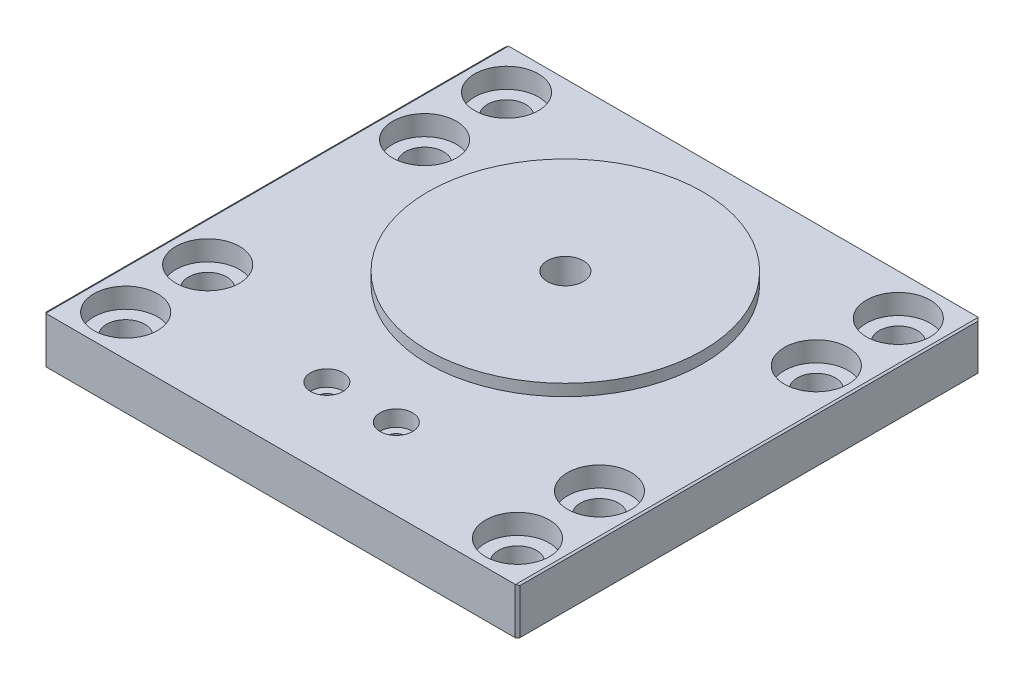
ISO-10303-21;
HEADER;
FILE_DESCRIPTION(('STEP AP214'),'2;1');
FILE_NAME('part.step','',(''),(''),'','','');
FILE_SCHEMA(('AUTOMOTIVE_DESIGN { 1 0 10303 214 1 1 1 1 }'));
ENDSEC;
DATA;
#1=APPLICATION_CONTEXT('core data for automotive mechanical design processes');
#2=APPLICATION_PROTOCOL_DEFINITION('international standard','automotive_design',2000,#1);
#3=PRODUCT_CONTEXT('',#1,'mechanical');
#4=PRODUCT('Part','Part','',(#3));
#5=PRODUCT_RELATED_PRODUCT_CATEGORY('part','',(#4));
#6=PRODUCT_DEFINITION_FORMATION('','',#4);
#7=PRODUCT_DEFINITION_CONTEXT('part definition',#1,'design');
#8=PRODUCT_DEFINITION('design','',#6,#7);
#9=PRODUCT_DEFINITION_SHAPE('','',#8);
#10=(LENGTH_UNIT() NAMED_UNIT(*) SI_UNIT(.MILLI.,.METRE.));
#11=(NAMED_UNIT(*) PLANE_ANGLE_UNIT() SI_UNIT($,.RADIAN.));
#12=(NAMED_UNIT(*) SI_UNIT($,.STERADIAN.) SOLID_ANGLE_UNIT());
#13=UNCERTAINTY_MEASURE_WITH_UNIT(LENGTH_MEASURE(1.E-05),#10,'distance_accuracy_value','');
#14=(GEOMETRIC_REPRESENTATION_CONTEXT(3) GLOBAL_UNCERTAINTY_ASSIGNED_CONTEXT((#13)) GLOBAL_UNIT_ASSIGNED_CONTEXT((#10,
#11,#12)) REPRESENTATION_CONTEXT('',''));
#15=CARTESIAN_POINT('',(0.,0.,0.));
#16=DIRECTION('',(0.,0.,1.));
#17=DIRECTION('',(1.,0.,0.));
#18=AXIS2_PLACEMENT_3D('',#15,#16,#17);
#19=CARTESIAN_POINT('',(-104.000000026,10.16,-101.6));
#20=DIRECTION('',(1.,0.,0.));
#21=DIRECTION('',(0.,0.,-1.));
#22=AXIS2_PLACEMENT_3D('',#19,#20,#21);
#23=PLANE('',#22);
#24=DIRECTION('',(0.,0.,1.));
#25=VECTOR('',#24,1.);
#26=CARTESIAN_POINT('',(-104.000000026,0.,-101.6));
#27=LINE('',#26,#25);
#28=CARTESIAN_POINT('',(-104.000000026,0.,-101.092));
#29=VERTEX_POINT('',#28);
#30=CARTESIAN_POINT('',(-104.000000026,0.,-0.507999999999953));
#31=VERTEX_POINT('',#30);
#32=EDGE_CURVE('E207',#29,#31,#27,.T.);
#33=ORIENTED_EDGE('',*,*,#32,.T.);
#34=DIRECTION('',(0.,1.,0.));
#35=VECTOR('',#34,1.);
#36=CARTESIAN_POINT('',(-104.000000026,10.16,-0.507999999999953));
#37=LINE('',#36,#35);
#38=CARTESIAN_POINT('',(-104.000000026,9.90599999999998,-0.507999999999953));
#39=VERTEX_POINT('',#38);
#40=EDGE_CURVE('E56',#31,#39,#37,.T.);
#41=ORIENTED_EDGE('',*,*,#40,.T.);
#42=DIRECTION('',(0.,0.,-1.));
#43=VECTOR('',#42,1.);
#44=CARTESIAN_POINT('',(-104.000000026,9.90599999999998,-101.6));
#45=LINE('',#44,#43);
#46=CARTESIAN_POINT('',(-104.000000026,9.90599999999998,-101.092));
#47=VERTEX_POINT('',#46);
#48=EDGE_CURVE('E124',#39,#47,#45,.T.);
#49=ORIENTED_EDGE('',*,*,#48,.T.);
#50=DIRECTION('',(0.,-1.,0.));
#51=VECTOR('',#50,1.);
#52=CARTESIAN_POINT('',(-104.000000026,10.16,-101.092));
#53=LINE('',#52,#51);
#54=EDGE_CURVE('E140',#47,#29,#53,.T.);
#55=ORIENTED_EDGE('',*,*,#54,.T.);
#56=EDGE_LOOP('',(#33,#41,#49,#55));
#57=FACE_BOUND('',#56,.T.);
#58=ADVANCED_FACE('F34',(#57),#23,.F.);
#59=CARTESIAN_POINT('',(-104.000000026,10.16,0.));
#60=DIRECTION('',(0.,0.,-1.));
#61=DIRECTION('',(-1.,0.,0.));
#62=AXIS2_PLACEMENT_3D('',#59,#60,#61);
#63=PLANE('',#62);
#64=DIRECTION('',(1.,0.,0.));
#65=VECTOR('',#64,1.);
#66=CARTESIAN_POINT('',(-104.000000026,0.,0.));
#67=LINE('',#66,#65);
#68=CARTESIAN_POINT('',(-103.492000026,0.,0.));
#69=VERTEX_POINT('',#68);
#70=CARTESIAN_POINT('',(-0.508000000000008,0.,0.));
#71=VERTEX_POINT('',#70);
#72=EDGE_CURVE('E170',#69,#71,#67,.T.);
#73=ORIENTED_EDGE('',*,*,#72,.T.);
#74=DIRECTION('',(0.,1.,0.));
#75=VECTOR('',#74,1.);
#76=CARTESIAN_POINT('',(-0.508000000000008,10.16,0.));
#77=LINE('',#76,#75);
#78=CARTESIAN_POINT('',(-0.508000000000008,10.16,0.));
#79=VERTEX_POINT('',#78);
#80=EDGE_CURVE('E189',#71,#79,#77,.T.);
#81=ORIENTED_EDGE('',*,*,#80,.T.);
#82=DIRECTION('',(1.,0.,0.));
#83=VECTOR('',#82,1.);
#84=CARTESIAN_POINT('',(-104.000000026,10.16,0.));
#85=LINE('',#84,#83);
#86=CARTESIAN_POINT('',(-103.492000026,10.16,0.));
#87=VERTEX_POINT('',#86);
#88=EDGE_CURVE('E166',#87,#79,#85,.T.);
#89=ORIENTED_EDGE('',*,*,#88,.F.);
#90=DIRECTION('',(0.,-1.,0.));
#91=VECTOR('',#90,1.);
#92=CARTESIAN_POINT('',(-103.492000026,10.16,0.));
#93=LINE('',#92,#91);
#94=EDGE_CURVE('E186',#87,#69,#93,.T.);
#95=ORIENTED_EDGE('',*,*,#94,.T.);
#96=EDGE_LOOP('',(#73,#81,#89,#95));
#97=FACE_BOUND('',#96,.T.);
#98=ADVANCED_FACE('F203',(#97),#63,.F.);
#99=CARTESIAN_POINT('',(0.,10.16,-101.6));
#100=DIRECTION('',(-1.,0.,0.));
#101=DIRECTION('',(0.,0.,1.));
#102=AXIS2_PLACEMENT_3D('',#99,#100,#101);
#103=PLANE('',#102);
#104=DIRECTION('',(0.,0.,1.));
#105=VECTOR('',#104,1.);
#106=CARTESIAN_POINT('',(0.,9.90600000000001,0.));
#107=LINE('',#106,#105);
#108=CARTESIAN_POINT('',(0.,9.90600000000001,-101.092));
#109=VERTEX_POINT('',#108);
#110=CARTESIAN_POINT('',(0.,9.90600000000001,-0.508000000000008));
#111=VERTEX_POINT('',#110);
#112=EDGE_CURVE('E117',#109,#111,#107,.T.);
#113=ORIENTED_EDGE('',*,*,#112,.T.);
#114=DIRECTION('',(0.,-1.,0.));
#115=VECTOR('',#114,1.);
#116=CARTESIAN_POINT('',(0.,10.16,-0.508000000000008));
#117=LINE('',#116,#115);
#118=CARTESIAN_POINT('',(0.,0.,-0.508000000000008));
#119=VERTEX_POINT('',#118);
#120=EDGE_CURVE('E123',#111,#119,#117,.T.);
#121=ORIENTED_EDGE('',*,*,#120,.T.);
#122=DIRECTION('',(0.,0.,-1.));
#123=VECTOR('',#122,1.);
#124=CARTESIAN_POINT('',(0.,0.,-101.6));
#125=LINE('',#124,#123);
#126=CARTESIAN_POINT('',(0.,0.,-101.092));
#127=VERTEX_POINT('',#126);
#128=EDGE_CURVE('E120',#119,#127,#125,.T.);
#129=ORIENTED_EDGE('',*,*,#128,.T.);
#130=DIRECTION('',(0.,1.,0.));
#131=VECTOR('',#130,1.);
#132=CARTESIAN_POINT('',(0.,10.16,-101.092));
#133=LINE('',#132,#131);
#134=EDGE_CURVE('E113',#127,#109,#133,.T.);
#135=ORIENTED_EDGE('',*,*,#134,.T.);
#136=EDGE_LOOP('',(#113,#121,#129,#135));
#137=FACE_BOUND('',#136,.T.);
#138=ADVANCED_FACE('F115',(#137),#103,.F.);
#139=CARTESIAN_POINT('',(-104.000000026,10.16,-101.6));
#140=DIRECTION('',(0.,0.,1.));
#141=DIRECTION('',(1.,0.,0.));
#142=AXIS2_PLACEMENT_3D('',#139,#140,#141);
#143=PLANE('',#142);
#144=DIRECTION('',(-1.,0.,0.));
#145=VECTOR('',#144,1.);
#146=CARTESIAN_POINT('',(-104.000000026,0.,-101.6));
#147=LINE('',#146,#145);
#148=CARTESIAN_POINT('',(-0.508000000000008,0.,-101.6));
#149=VERTEX_POINT('',#148);
#150=CARTESIAN_POINT('',(-103.492000026,0.,-101.6));
#151=VERTEX_POINT('',#150);
#152=EDGE_CURVE('E157',#149,#151,#147,.T.);
#153=ORIENTED_EDGE('',*,*,#152,.T.);
#154=DIRECTION('',(0.,1.,0.));
#155=VECTOR('',#154,1.);
#156=CARTESIAN_POINT('',(-103.492000026,10.16,-101.6));
#157=LINE('',#156,#155);
#158=CARTESIAN_POINT('',(-103.492000026,10.16,-101.6));
#159=VERTEX_POINT('',#158);
#160=EDGE_CURVE('E11',#151,#159,#157,.T.);
#161=ORIENTED_EDGE('',*,*,#160,.T.);
#162=DIRECTION('',(-1.,0.,0.));
#163=VECTOR('',#162,1.);
#164=CARTESIAN_POINT('',(-104.000000026,10.16,-101.6));
#165=LINE('',#164,#163);
#166=CARTESIAN_POINT('',(-0.508000000000008,10.16,-101.6));
#167=VERTEX_POINT('',#166);
#168=EDGE_CURVE('E160',#167,#159,#165,.T.);
#169=ORIENTED_EDGE('',*,*,#168,.F.);
#170=DIRECTION('',(0.,-1.,0.));
#171=VECTOR('',#170,1.);
#172=CARTESIAN_POINT('',(-0.508000000000008,10.16,-101.6));
#173=LINE('',#172,#171);
#174=EDGE_CURVE('E42',#167,#149,#173,.T.);
#175=ORIENTED_EDGE('',*,*,#174,.T.);
#176=EDGE_LOOP('',(#153,#161,#169,#175));
#177=FACE_BOUND('',#176,.T.);
#178=ADVANCED_FACE('F156',(#177),#143,.F.);
#179=CARTESIAN_POINT('',(0.,10.16,0.));
#180=DIRECTION('',(0.,1.,0.));
#181=DIRECTION('',(0.,0.,1.));
#182=AXIS2_PLACEMENT_3D('',#179,#180,#181);
#183=PLANE('',#182);
#184=CARTESIAN_POINT('',(-8.99999996132552,10.16,-92.6));
#185=DIRECTION('',(0.,1.,0.));
#186=DIRECTION('',(0.,0.,1.));
#187=AXIS2_PLACEMENT_3D('',#184,#185,#186);
#188=CIRCLE('',#187,7.);
#189=CARTESIAN_POINT('',(-8.99999996132552,10.16,-85.6));
#190=VERTEX_POINT('',#189);
#191=EDGE_CURVE('E341',#190,#190,#188,.T.);
#192=ORIENTED_EDGE('',*,*,#191,.F.);
#193=EDGE_LOOP('',(#192));
#194=FACE_BOUND('',#193,.T.);
#195=CARTESIAN_POINT('',(-8.99999996132552,10.16,-74.6));
#196=DIRECTION('',(0.,1.,0.));
#197=DIRECTION('',(0.,0.,1.));
#198=AXIS2_PLACEMENT_3D('',#195,#196,#197);
#199=CIRCLE('',#198,7.);
#200=CARTESIAN_POINT('',(-8.99999996132552,10.16,-67.6));
#201=VERTEX_POINT('',#200);
#202=EDGE_CURVE('E329',#201,#201,#199,.T.);
#203=ORIENTED_EDGE('',*,*,#202,.F.);
#204=EDGE_LOOP('',(#203));
#205=FACE_BOUND('',#204,.T.);
#206=CARTESIAN_POINT('',(-8.99999996132554,10.16,-27.));
#207=DIRECTION('',(0.,1.,0.));
#208=DIRECTION('',(0.,0.,1.));
#209=AXIS2_PLACEMENT_3D('',#206,#207,#208);
#210=CIRCLE('',#209,7.);
#211=CARTESIAN_POINT('',(-8.99999996132554,10.16,-20.));
#212=VERTEX_POINT('',#211);
#213=EDGE_CURVE('E317',#212,#212,#210,.T.);
#214=ORIENTED_EDGE('',*,*,#213,.F.);
#215=EDGE_LOOP('',(#214));
#216=FACE_BOUND('',#215,.T.);
#217=CARTESIAN_POINT('',(-8.99999996132554,10.16,-8.99999999999997));
#218=DIRECTION('',(0.,1.,0.));
#219=DIRECTION('',(0.,0.,1.));
#220=AXIS2_PLACEMENT_3D('',#217,#218,#219);
#221=CIRCLE('',#220,7.);
#222=CARTESIAN_POINT('',(-8.99999996132554,10.16,-1.99999999999997));
#223=VERTEX_POINT('',#222);
#224=EDGE_CURVE('E305',#223,#223,#221,.T.);
#225=ORIENTED_EDGE('',*,*,#224,.F.);
#226=EDGE_LOOP('',(#225));
#227=FACE_BOUND('',#226,.T.);
#228=CARTESIAN_POINT('',(-95.000000013,10.16,-8.99999999999995));
#229=DIRECTION('',(0.,1.,0.));
#230=DIRECTION('',(0.,0.,1.));
#231=AXIS2_PLACEMENT_3D('',#228,#229,#230);
#232=CIRCLE('',#231,7.00000000000001);
#233=CARTESIAN_POINT('',(-95.000000013,10.16,-1.99999999999995));
#234=VERTEX_POINT('',#233);
#235=EDGE_CURVE('E293',#234,#234,#232,.T.);
#236=ORIENTED_EDGE('',*,*,#235,.F.);
#237=EDGE_LOOP('',(#236));
#238=FACE_BOUND('',#237,.T.);
#239=CARTESIAN_POINT('',(-95.000000013,10.16,-27.));
#240=DIRECTION('',(0.,1.,0.));
#241=DIRECTION('',(0.,0.,1.));
#242=AXIS2_PLACEMENT_3D('',#239,#240,#241);
#243=CIRCLE('',#242,7.00000000000001);
#244=CARTESIAN_POINT('',(-95.000000013,10.16,-19.9999999999999));
#245=VERTEX_POINT('',#244);
#246=EDGE_CURVE('E281',#245,#245,#243,.T.);
#247=ORIENTED_EDGE('',*,*,#246,.F.);
#248=EDGE_LOOP('',(#247));
#249=FACE_BOUND('',#248,.T.);
#250=CARTESIAN_POINT('',(-95.000000013,10.16,-74.6));
#251=DIRECTION('',(0.,1.,0.));
#252=DIRECTION('',(0.,0.,1.));
#253=AXIS2_PLACEMENT_3D('',#250,#251,#252);
#254=CIRCLE('',#253,7.00000000000001);
#255=CARTESIAN_POINT('',(-95.000000013,10.16,-67.6));
#256=VERTEX_POINT('',#255);
#257=EDGE_CURVE('E269',#256,#256,#254,.T.);
#258=ORIENTED_EDGE('',*,*,#257,.F.);
#259=EDGE_LOOP('',(#258));
#260=FACE_BOUND('',#259,.T.);
#261=CARTESIAN_POINT('',(-95.000000013,10.16,-92.6));
#262=DIRECTION('',(0.,1.,0.));
#263=DIRECTION('',(0.,0.,1.));
#264=AXIS2_PLACEMENT_3D('',#261,#262,#263);
#265=CIRCLE('',#264,7.00000000000001);
#266=CARTESIAN_POINT('',(-95.000000013,10.16,-85.6));
#267=VERTEX_POINT('',#266);
#268=EDGE_CURVE('E257',#267,#267,#265,.T.);
#269=ORIENTED_EDGE('',*,*,#268,.F.);
#270=EDGE_LOOP('',(#269));
#271=FACE_BOUND('',#270,.T.);
#272=CARTESIAN_POINT('',(-59.620000013,10.16,-17.78));
#273=DIRECTION('',(0.,1.,0.));
#274=DIRECTION('',(0.,0.,1.));
#275=AXIS2_PLACEMENT_3D('',#272,#273,#274);
#276=CIRCLE('',#275,3.57251);
#277=CARTESIAN_POINT('',(-59.620000013,10.16,-14.20749));
#278=VERTEX_POINT('',#277);
#279=EDGE_CURVE('E239',#278,#278,#276,.T.);
#280=ORIENTED_EDGE('',*,*,#279,.F.);
#281=EDGE_LOOP('',(#280));
#282=FACE_BOUND('',#281,.T.);
#283=CARTESIAN_POINT('',(-44.380000013,10.16,-17.78));
#284=DIRECTION('',(0.,1.,0.));
#285=DIRECTION('',(0.,0.,1.));
#286=AXIS2_PLACEMENT_3D('',#283,#284,#285);
#287=CIRCLE('',#286,3.57251);
#288=CARTESIAN_POINT('',(-44.380000013,10.16,-14.20749));
#289=VERTEX_POINT('',#288);
#290=EDGE_CURVE('E227',#289,#289,#287,.T.);
#291=ORIENTED_EDGE('',*,*,#290,.F.);
#292=EDGE_LOOP('',(#291));
#293=FACE_BOUND('',#292,.T.);
#294=CARTESIAN_POINT('',(-52.000000013,10.16,-62.5094));
#295=DIRECTION('',(0.,1.,0.));
#296=DIRECTION('',(0.,0.,1.));
#297=AXIS2_PLACEMENT_3D('',#294,#295,#296);
#298=CIRCLE('',#297,30.1625);
#299=CARTESIAN_POINT('',(-52.000000013,10.16,-32.3469));
#300=VERTEX_POINT('',#299);
#301=EDGE_CURVE('E212',#300,#300,#298,.T.);
#302=ORIENTED_EDGE('',*,*,#301,.F.);
#303=EDGE_LOOP('',(#302));
#304=FACE_BOUND('',#303,.T.);
#305=ORIENTED_EDGE('',*,*,#88,.T.);
#306=DIRECTION('',(-0.707106781186548,0.,0.707106781186548));
#307=VECTOR('',#306,1.);
#308=CARTESIAN_POINT('',(-0.254000000000004,10.16,-0.254000000000004));
#309=LINE('',#308,#307);
#310=CARTESIAN_POINT('',(-0.439940905122477,10.16,-0.0680590948775178));
#311=VERTEX_POINT('',#310);
#312=EDGE_CURVE('E138',#79,#311,#309,.F.);
#313=ORIENTED_EDGE('',*,*,#312,.T.);
#314=DIRECTION('',(0.,0.,-1.));
#315=VECTOR('',#314,1.);
#316=CARTESIAN_POINT('',(-0.439940905122477,10.16,-101.6));
#317=LINE('',#316,#315);
#318=CARTESIAN_POINT('',(-0.439940905122477,10.16,-101.531940905122));
#319=VERTEX_POINT('',#318);
#320=EDGE_CURVE('E133',#311,#319,#317,.T.);
#321=ORIENTED_EDGE('',*,*,#320,.T.);
#322=DIRECTION('',(0.707106781186547,0.,0.707106781186548));
#323=VECTOR('',#322,1.);
#324=CARTESIAN_POINT('',(50.546,10.16,-50.546));
#325=LINE('',#324,#323);
#326=EDGE_CURVE('E137',#319,#167,#325,.F.);
#327=ORIENTED_EDGE('',*,*,#326,.T.);
#328=ORIENTED_EDGE('',*,*,#168,.T.);
#329=DIRECTION('',(0.707106781186538,0.,-0.707106781186557));
#330=VECTOR('',#329,1.);
#331=CARTESIAN_POINT('',(-102.546000013001,10.16,-102.546000012999));
#332=LINE('',#331,#330);
#333=CARTESIAN_POINT('',(-103.560059120877,10.16,-101.531940905123));
#334=VERTEX_POINT('',#333);
#335=EDGE_CURVE('E192',#159,#334,#332,.F.);
#336=ORIENTED_EDGE('',*,*,#335,.T.);
#337=DIRECTION('',(0.,0.,1.));
#338=VECTOR('',#337,1.);
#339=CARTESIAN_POINT('',(-103.560059120877,10.16,0.));
#340=LINE('',#339,#338);
#341=CARTESIAN_POINT('',(-103.560059120877,10.16,-0.0680590948774188));
#342=VERTEX_POINT('',#341);
#343=EDGE_CURVE('E174',#334,#342,#340,.T.);
#344=ORIENTED_EDGE('',*,*,#343,.T.);
#345=DIRECTION('',(-0.707106781186557,0.,-0.707106781186538));
#346=VECTOR('',#345,1.);
#347=CARTESIAN_POINT('',(-51.7460000129986,10.16,51.746000013));
#348=LINE('',#347,#346);
#349=EDGE_CURVE('E142',#342,#87,#348,.F.);
#350=ORIENTED_EDGE('',*,*,#349,.T.);
#351=EDGE_LOOP('',(#305,#313,#321,#327,#328,#336,#344,#350));
#352=FACE_BOUND('',#351,.T.);
#353=ADVANCED_FACE('F196',(#194,#205,#216,#227,#238,#249,#260,#271,#282,#293,#304,#352),#183,.T.);
#354=CARTESIAN_POINT('',(0.,0.,0.));
#355=DIRECTION('',(0.,1.,0.));
#356=DIRECTION('',(0.,0.,1.));
#357=AXIS2_PLACEMENT_3D('',#354,#355,#356);
#358=PLANE('',#357);
#359=CARTESIAN_POINT('',(-8.99999996132552,0.,-92.6));
#360=DIRECTION('',(0.,1.,0.));
#361=DIRECTION('',(0.,0.,1.));
#362=AXIS2_PLACEMENT_3D('',#359,#360,#361);
#363=CIRCLE('',#362,4.2);
#364=CARTESIAN_POINT('',(-8.99999996132552,0.,-88.4));
#365=VERTEX_POINT('',#364);
#366=EDGE_CURVE('E332',#365,#365,#363,.T.);
#367=ORIENTED_EDGE('',*,*,#366,.T.);
#368=EDGE_LOOP('',(#367));
#369=FACE_BOUND('',#368,.T.);
#370=CARTESIAN_POINT('',(-8.99999996132552,0.,-74.6));
#371=DIRECTION('',(0.,1.,0.));
#372=DIRECTION('',(0.,0.,1.));
#373=AXIS2_PLACEMENT_3D('',#370,#371,#372);
#374=CIRCLE('',#373,4.2);
#375=CARTESIAN_POINT('',(-8.99999996132552,0.,-70.4));
#376=VERTEX_POINT('',#375);
#377=EDGE_CURVE('E320',#376,#376,#374,.T.);
#378=ORIENTED_EDGE('',*,*,#377,.T.);
#379=EDGE_LOOP('',(#378));
#380=FACE_BOUND('',#379,.T.);
#381=CARTESIAN_POINT('',(-8.99999996132554,0.,-27.));
#382=DIRECTION('',(0.,1.,0.));
#383=DIRECTION('',(0.,0.,1.));
#384=AXIS2_PLACEMENT_3D('',#381,#382,#383);
#385=CIRCLE('',#384,4.2);
#386=CARTESIAN_POINT('',(-8.99999996132554,0.,-22.8));
#387=VERTEX_POINT('',#386);
#388=EDGE_CURVE('E308',#387,#387,#385,.T.);
#389=ORIENTED_EDGE('',*,*,#388,.T.);
#390=EDGE_LOOP('',(#389));
#391=FACE_BOUND('',#390,.T.);
#392=CARTESIAN_POINT('',(-8.99999996132554,0.,-8.99999999999997));
#393=DIRECTION('',(0.,1.,0.));
#394=DIRECTION('',(0.,0.,1.));
#395=AXIS2_PLACEMENT_3D('',#392,#393,#394);
#396=CIRCLE('',#395,4.2);
#397=CARTESIAN_POINT('',(-8.99999996132554,0.,-4.79999999999997));
#398=VERTEX_POINT('',#397);
#399=EDGE_CURVE('E296',#398,#398,#396,.T.);
#400=ORIENTED_EDGE('',*,*,#399,.T.);
#401=EDGE_LOOP('',(#400));
#402=FACE_BOUND('',#401,.T.);
#403=CARTESIAN_POINT('',(-95.000000013,0.,-8.99999999999995));
#404=DIRECTION('',(0.,1.,0.));
#405=DIRECTION('',(0.,0.,1.));
#406=AXIS2_PLACEMENT_3D('',#403,#404,#405);
#407=CIRCLE('',#406,4.2);
#408=CARTESIAN_POINT('',(-95.000000013,0.,-4.79999999999996));
#409=VERTEX_POINT('',#408);
#410=EDGE_CURVE('E284',#409,#409,#407,.T.);
#411=ORIENTED_EDGE('',*,*,#410,.T.);
#412=EDGE_LOOP('',(#411));
#413=FACE_BOUND('',#412,.T.);
#414=CARTESIAN_POINT('',(-95.000000013,0.,-27.));
#415=DIRECTION('',(0.,1.,0.));
#416=DIRECTION('',(0.,0.,1.));
#417=AXIS2_PLACEMENT_3D('',#414,#415,#416);
#418=CIRCLE('',#417,4.2);
#419=CARTESIAN_POINT('',(-95.000000013,0.,-22.8));
#420=VERTEX_POINT('',#419);
#421=EDGE_CURVE('E272',#420,#420,#418,.T.);
#422=ORIENTED_EDGE('',*,*,#421,.T.);
#423=EDGE_LOOP('',(#422));
#424=FACE_BOUND('',#423,.T.);
#425=CARTESIAN_POINT('',(-95.000000013,0.,-74.6));
#426=DIRECTION('',(0.,1.,0.));
#427=DIRECTION('',(0.,0.,1.));
#428=AXIS2_PLACEMENT_3D('',#425,#426,#427);
#429=CIRCLE('',#428,4.2);
#430=CARTESIAN_POINT('',(-95.000000013,0.,-70.4));
#431=VERTEX_POINT('',#430);
#432=EDGE_CURVE('E260',#431,#431,#429,.T.);
#433=ORIENTED_EDGE('',*,*,#432,.T.);
#434=EDGE_LOOP('',(#433));
#435=FACE_BOUND('',#434,.T.);
#436=CARTESIAN_POINT('',(-95.000000013,0.,-92.6));
#437=DIRECTION('',(0.,1.,0.));
#438=DIRECTION('',(0.,0.,1.));
#439=AXIS2_PLACEMENT_3D('',#436,#437,#438);
#440=CIRCLE('',#439,4.2);
#441=CARTESIAN_POINT('',(-95.000000013,0.,-88.4));
#442=VERTEX_POINT('',#441);
#443=EDGE_CURVE('E248',#442,#442,#440,.T.);
#444=ORIENTED_EDGE('',*,*,#443,.T.);
#445=EDGE_LOOP('',(#444));
#446=FACE_BOUND('',#445,.T.);
#447=CARTESIAN_POINT('',(-52.000000013,0.,-62.5094));
#448=DIRECTION('',(0.,1.,0.));
#449=DIRECTION('',(0.,0.,1.));
#450=AXIS2_PLACEMENT_3D('',#447,#448,#449);
#451=CIRCLE('',#450,3.96874999999994);
#452=CARTESIAN_POINT('',(-52.000000013,0.,-58.5406500000001));
#453=VERTEX_POINT('',#452);
#454=EDGE_CURVE('E242',#453,#453,#451,.T.);
#455=ORIENTED_EDGE('',*,*,#454,.T.);
#456=EDGE_LOOP('',(#455));
#457=FACE_BOUND('',#456,.T.);
#458=CARTESIAN_POINT('',(-59.620000013,0.,-17.78));
#459=DIRECTION('',(0.,1.,0.));
#460=DIRECTION('',(0.,0.,1.));
#461=AXIS2_PLACEMENT_3D('',#458,#459,#460);
#462=CIRCLE('',#461,1.89864999999999);
#463=CARTESIAN_POINT('',(-59.620000013,0.,-15.88135));
#464=VERTEX_POINT('',#463);
#465=EDGE_CURVE('E230',#464,#464,#462,.T.);
#466=ORIENTED_EDGE('',*,*,#465,.T.);
#467=EDGE_LOOP('',(#466));
#468=FACE_BOUND('',#467,.T.);
#469=CARTESIAN_POINT('',(-44.380000013,0.,-17.78));
#470=DIRECTION('',(0.,1.,0.));
#471=DIRECTION('',(0.,0.,1.));
#472=AXIS2_PLACEMENT_3D('',#469,#470,#471);
#473=CIRCLE('',#472,1.89864999999999);
#474=CARTESIAN_POINT('',(-44.380000013,0.,-15.88135));
#475=VERTEX_POINT('',#474);
#476=EDGE_CURVE('E217',#475,#475,#473,.T.);
#477=ORIENTED_EDGE('',*,*,#476,.T.);
#478=EDGE_LOOP('',(#477));
#479=FACE_BOUND('',#478,.T.);
#480=ORIENTED_EDGE('',*,*,#128,.F.);
#481=DIRECTION('',(0.707106781186548,0.,-0.707106781186548));
#482=VECTOR('',#481,1.);
#483=CARTESIAN_POINT('',(0.,0.,-0.508000000000008));
#484=LINE('',#483,#482);
#485=EDGE_CURVE('E184',#119,#71,#484,.F.);
#486=ORIENTED_EDGE('',*,*,#485,.T.);
#487=ORIENTED_EDGE('',*,*,#72,.F.);
#488=DIRECTION('',(0.707106781186557,0.,0.707106781186538));
#489=VECTOR('',#488,1.);
#490=CARTESIAN_POINT('',(-103.492000026,0.,0.));
#491=LINE('',#490,#489);
#492=EDGE_CURVE('E182',#69,#31,#491,.F.);
#493=ORIENTED_EDGE('',*,*,#492,.T.);
#494=ORIENTED_EDGE('',*,*,#32,.F.);
#495=DIRECTION('',(-0.707106781186538,0.,0.707106781186557));
#496=VECTOR('',#495,1.);
#497=CARTESIAN_POINT('',(-104.000000026,0.,-101.092));
#498=LINE('',#497,#496);
#499=EDGE_CURVE('E165',#29,#151,#498,.F.);
#500=ORIENTED_EDGE('',*,*,#499,.T.);
#501=ORIENTED_EDGE('',*,*,#152,.F.);
#502=DIRECTION('',(-0.707106781186547,0.,-0.707106781186548));
#503=VECTOR('',#502,1.);
#504=CARTESIAN_POINT('',(-0.508000000000008,0.,-101.6));
#505=LINE('',#504,#503);
#506=EDGE_CURVE('E163',#149,#127,#505,.F.);
#507=ORIENTED_EDGE('',*,*,#506,.T.);
#508=EDGE_LOOP('',(#480,#486,#487,#493,#494,#500,#501,#507));
#509=FACE_BOUND('',#508,.T.);
#510=ADVANCED_FACE('F162',(#369,#380,#391,#402,#413,#424,#435,#446,#457,#468,#479,#509),#358,.F.);
#511=CARTESIAN_POINT('',(-52.000000013,12.7,-62.5094));
#512=DIRECTION('',(0.,-1.,0.));
#513=DIRECTION('',(0.,0.,-1.));
#514=AXIS2_PLACEMENT_3D('',#511,#512,#513);
#515=CYLINDRICAL_SURFACE('',#514,30.1625);
#516=CARTESIAN_POINT('',(-52.000000013,12.7,-62.5094));
#517=DIRECTION('',(0.,1.,0.));
#518=DIRECTION('',(0.,0.,1.));
#519=AXIS2_PLACEMENT_3D('',#516,#517,#518);
#520=CIRCLE('',#519,30.1625);
#521=CARTESIAN_POINT('',(-52.000000013,12.7,-32.3469));
#522=VERTEX_POINT('',#521);
#523=EDGE_CURVE('E209',#522,#522,#520,.T.);
#524=ORIENTED_EDGE('',*,*,#523,.F.);
#525=EDGE_LOOP('',(#524));
#526=FACE_BOUND('',#525,.T.);
#527=ORIENTED_EDGE('',*,*,#301,.T.);
#528=EDGE_LOOP('',(#527));
#529=FACE_BOUND('',#528,.T.);
#530=ADVANCED_FACE('F370',(#526,#529),#515,.T.);
#531=CARTESIAN_POINT('',(-52.000000013,12.7,-62.5094));
#532=DIRECTION('',(0.,1.,0.));
#533=DIRECTION('',(0.,0.,1.));
#534=AXIS2_PLACEMENT_3D('',#531,#532,#533);
#535=PLANE('',#534);
#536=CARTESIAN_POINT('',(-52.000000013,12.7,-62.5094));
#537=DIRECTION('',(0.,1.,0.));
#538=DIRECTION('',(0.,0.,1.));
#539=AXIS2_PLACEMENT_3D('',#536,#537,#538);
#540=CIRCLE('',#539,3.96874999999999);
#541=CARTESIAN_POINT('',(-52.000000013,12.7,-58.54065));
#542=VERTEX_POINT('',#541);
#543=EDGE_CURVE('E245',#542,#542,#540,.T.);
#544=ORIENTED_EDGE('',*,*,#543,.F.);
#545=EDGE_LOOP('',(#544));
#546=FACE_BOUND('',#545,.T.);
#547=ORIENTED_EDGE('',*,*,#523,.T.);
#548=EDGE_LOOP('',(#547));
#549=FACE_BOUND('',#548,.T.);
#550=ADVANCED_FACE('F372',(#546,#549),#535,.T.);
#551=CARTESIAN_POINT('',(-44.380000013,10.16,-17.78));
#552=DIRECTION('',(0.,1.,0.));
#553=DIRECTION('',(0.,0.,1.));
#554=AXIS2_PLACEMENT_3D('',#551,#552,#553);
#555=CYLINDRICAL_SURFACE('',#554,1.89865);
#556=ORIENTED_EDGE('',*,*,#476,.F.);
#557=EDGE_LOOP('',(#556));
#558=FACE_BOUND('',#557,.T.);
#559=CARTESIAN_POINT('',(-44.380000013,6.6548,-17.78));
#560=DIRECTION('',(0.,1.,0.));
#561=DIRECTION('',(0.,0.,1.));
#562=AXIS2_PLACEMENT_3D('',#559,#560,#561);
#563=CIRCLE('',#562,1.89865);
#564=CARTESIAN_POINT('',(-44.380000013,6.6548,-15.88135));
#565=VERTEX_POINT('',#564);
#566=EDGE_CURVE('E221',#565,#565,#563,.T.);
#567=ORIENTED_EDGE('',*,*,#566,.T.);
#568=EDGE_LOOP('',(#567));
#569=FACE_BOUND('',#568,.T.);
#570=ADVANCED_FACE('F379',(#558,#569),#555,.F.);
#571=CARTESIAN_POINT('',(-42.481350013,6.6548,-17.78));
#572=DIRECTION('',(0.,-1.,0.));
#573=DIRECTION('',(0.,0.,-1.));
#574=AXIS2_PLACEMENT_3D('',#571,#572,#573);
#575=PLANE('',#574);
#576=ORIENTED_EDGE('',*,*,#566,.F.);
#577=EDGE_LOOP('',(#576));
#578=FACE_BOUND('',#577,.T.);
#579=CARTESIAN_POINT('',(-44.380000013,6.6548,-17.78));
#580=DIRECTION('',(0.,1.,0.));
#581=DIRECTION('',(0.,0.,1.));
#582=AXIS2_PLACEMENT_3D('',#579,#580,#581);
#583=CIRCLE('',#582,3.57251);
#584=CARTESIAN_POINT('',(-44.380000013,6.6548,-14.20749));
#585=VERTEX_POINT('',#584);
#586=EDGE_CURVE('E224',#585,#585,#583,.T.);
#587=ORIENTED_EDGE('',*,*,#586,.T.);
#588=EDGE_LOOP('',(#587));
#589=FACE_BOUND('',#588,.T.);
#590=ADVANCED_FACE('F814',(#578,#589),#575,.F.);
#591=CARTESIAN_POINT('',(-44.380000013,10.16,-17.78));
#592=DIRECTION('',(0.,1.,0.));
#593=DIRECTION('',(0.,0.,1.));
#594=AXIS2_PLACEMENT_3D('',#591,#592,#593);
#595=CYLINDRICAL_SURFACE('',#594,3.57251);
#596=ORIENTED_EDGE('',*,*,#586,.F.);
#597=EDGE_LOOP('',(#596));
#598=FACE_BOUND('',#597,.T.);
#599=ORIENTED_EDGE('',*,*,#290,.T.);
#600=EDGE_LOOP('',(#599));
#601=FACE_BOUND('',#600,.T.);
#602=ADVANCED_FACE('F803',(#598,#601),#595,.F.);
#603=CARTESIAN_POINT('',(-59.620000013,10.16,-17.78));
#604=DIRECTION('',(0.,1.,0.));
#605=DIRECTION('',(0.,0.,1.));
#606=AXIS2_PLACEMENT_3D('',#603,#604,#605);
#607=CYLINDRICAL_SURFACE('',#606,1.89865);
#608=ORIENTED_EDGE('',*,*,#465,.F.);
#609=EDGE_LOOP('',(#608));
#610=FACE_BOUND('',#609,.T.);
#611=CARTESIAN_POINT('',(-59.620000013,6.6548,-17.78));
#612=DIRECTION('',(0.,1.,0.));
#613=DIRECTION('',(0.,0.,1.));
#614=AXIS2_PLACEMENT_3D('',#611,#612,#613);
#615=CIRCLE('',#614,1.89865);
#616=CARTESIAN_POINT('',(-59.620000013,6.6548,-15.88135));
#617=VERTEX_POINT('',#616);
#618=EDGE_CURVE('E233',#617,#617,#615,.T.);
#619=ORIENTED_EDGE('',*,*,#618,.T.);
#620=EDGE_LOOP('',(#619));
#621=FACE_BOUND('',#620,.T.);
#622=ADVANCED_FACE('F792',(#610,#621),#607,.F.);
#623=CARTESIAN_POINT('',(-57.721350013,6.6548,-17.78));
#624=DIRECTION('',(0.,-1.,0.));
#625=DIRECTION('',(0.,0.,-1.));
#626=AXIS2_PLACEMENT_3D('',#623,#624,#625);
#627=PLANE('',#626);
#628=ORIENTED_EDGE('',*,*,#618,.F.);
#629=EDGE_LOOP('',(#628));
#630=FACE_BOUND('',#629,.T.);
#631=CARTESIAN_POINT('',(-59.620000013,6.6548,-17.78));
#632=DIRECTION('',(0.,1.,0.));
#633=DIRECTION('',(0.,0.,1.));
#634=AXIS2_PLACEMENT_3D('',#631,#632,#633);
#635=CIRCLE('',#634,3.57251);
#636=CARTESIAN_POINT('',(-59.620000013,6.6548,-14.20749));
#637=VERTEX_POINT('',#636);
#638=EDGE_CURVE('E236',#637,#637,#635,.T.);
#639=ORIENTED_EDGE('',*,*,#638,.T.);
#640=EDGE_LOOP('',(#639));
#641=FACE_BOUND('',#640,.T.);
#642=ADVANCED_FACE('F781',(#630,#641),#627,.F.);
#643=CARTESIAN_POINT('',(-59.620000013,10.16,-17.78));
#644=DIRECTION('',(0.,1.,0.));
#645=DIRECTION('',(0.,0.,1.));
#646=AXIS2_PLACEMENT_3D('',#643,#644,#645);
#647=CYLINDRICAL_SURFACE('',#646,3.57251);
#648=ORIENTED_EDGE('',*,*,#638,.F.);
#649=EDGE_LOOP('',(#648));
#650=FACE_BOUND('',#649,.T.);
#651=ORIENTED_EDGE('',*,*,#279,.T.);
#652=EDGE_LOOP('',(#651));
#653=FACE_BOUND('',#652,.T.);
#654=ADVANCED_FACE('F762',(#650,#653),#647,.F.);
#655=CARTESIAN_POINT('',(-52.000000013,12.7,-62.5094));
#656=DIRECTION('',(0.,1.,0.));
#657=DIRECTION('',(0.,0.,1.));
#658=AXIS2_PLACEMENT_3D('',#655,#656,#657);
#659=CYLINDRICAL_SURFACE('',#658,3.96874999999997);
#660=ORIENTED_EDGE('',*,*,#454,.F.);
#661=EDGE_LOOP('',(#660));
#662=FACE_BOUND('',#661,.T.);
#663=ORIENTED_EDGE('',*,*,#543,.T.);
#664=EDGE_LOOP('',(#663));
#665=FACE_BOUND('',#664,.T.);
#666=ADVANCED_FACE('F750',(#662,#665),#659,.F.);
#667=CARTESIAN_POINT('',(-95.000000013,10.16,-92.6));
#668=DIRECTION('',(0.,1.,0.));
#669=DIRECTION('',(0.,0.,1.));
#670=AXIS2_PLACEMENT_3D('',#667,#668,#669);
#671=CYLINDRICAL_SURFACE('',#670,4.2);
#672=ORIENTED_EDGE('',*,*,#443,.F.);
#673=EDGE_LOOP('',(#672));
#674=FACE_BOUND('',#673,.T.);
#675=CARTESIAN_POINT('',(-95.000000013,5.76,-92.6));
#676=DIRECTION('',(0.,1.,0.));
#677=DIRECTION('',(0.,0.,1.));
#678=AXIS2_PLACEMENT_3D('',#675,#676,#677);
#679=CIRCLE('',#678,4.2);
#680=CARTESIAN_POINT('',(-95.000000013,5.76,-88.4));
#681=VERTEX_POINT('',#680);
#682=EDGE_CURVE('E251',#681,#681,#679,.T.);
#683=ORIENTED_EDGE('',*,*,#682,.T.);
#684=EDGE_LOOP('',(#683));
#685=FACE_BOUND('',#684,.T.);
#686=ADVANCED_FACE('F739',(#674,#685),#671,.F.);
#687=CARTESIAN_POINT('',(-90.800000013,5.76,-92.6));
#688=DIRECTION('',(0.,-1.,0.));
#689=DIRECTION('',(0.,0.,-1.));
#690=AXIS2_PLACEMENT_3D('',#687,#688,#689);
#691=PLANE('',#690);
#692=ORIENTED_EDGE('',*,*,#682,.F.);
#693=EDGE_LOOP('',(#692));
#694=FACE_BOUND('',#693,.T.);
#695=CARTESIAN_POINT('',(-95.000000013,5.76,-92.6));
#696=DIRECTION('',(0.,1.,0.));
#697=DIRECTION('',(0.,0.,1.));
#698=AXIS2_PLACEMENT_3D('',#695,#696,#697);
#699=CIRCLE('',#698,6.99999999999999);
#700=CARTESIAN_POINT('',(-95.000000013,5.76,-85.6));
#701=VERTEX_POINT('',#700);
#702=EDGE_CURVE('E254',#701,#701,#699,.T.);
#703=ORIENTED_EDGE('',*,*,#702,.T.);
#704=EDGE_LOOP('',(#703));
#705=FACE_BOUND('',#704,.T.);
#706=ADVANCED_FACE('F728',(#694,#705),#691,.F.);
#707=CARTESIAN_POINT('',(-95.000000013,10.16,-92.6));
#708=DIRECTION('',(0.,1.,0.));
#709=DIRECTION('',(0.,0.,1.));
#710=AXIS2_PLACEMENT_3D('',#707,#708,#709);
#711=CYLINDRICAL_SURFACE('',#710,7.);
#712=ORIENTED_EDGE('',*,*,#702,.F.);
#713=EDGE_LOOP('',(#712));
#714=FACE_BOUND('',#713,.T.);
#715=ORIENTED_EDGE('',*,*,#268,.T.);
#716=EDGE_LOOP('',(#715));
#717=FACE_BOUND('',#716,.T.);
#718=ADVANCED_FACE('F717',(#714,#717),#711,.F.);
#719=CARTESIAN_POINT('',(-95.000000013,10.16,-74.6));
#720=DIRECTION('',(0.,1.,0.));
#721=DIRECTION('',(0.,0.,1.));
#722=AXIS2_PLACEMENT_3D('',#719,#720,#721);
#723=CYLINDRICAL_SURFACE('',#722,4.2);
#724=ORIENTED_EDGE('',*,*,#432,.F.);
#725=EDGE_LOOP('',(#724));
#726=FACE_BOUND('',#725,.T.);
#727=CARTESIAN_POINT('',(-95.000000013,5.76,-74.6));
#728=DIRECTION('',(0.,1.,0.));
#729=DIRECTION('',(0.,0.,1.));
#730=AXIS2_PLACEMENT_3D('',#727,#728,#729);
#731=CIRCLE('',#730,4.2);
#732=CARTESIAN_POINT('',(-95.000000013,5.76,-70.4));
#733=VERTEX_POINT('',#732);
#734=EDGE_CURVE('E263',#733,#733,#731,.T.);
#735=ORIENTED_EDGE('',*,*,#734,.T.);
#736=EDGE_LOOP('',(#735));
#737=FACE_BOUND('',#736,.T.);
#738=ADVANCED_FACE('F706',(#726,#737),#723,.F.);
#739=CARTESIAN_POINT('',(-90.800000013,5.76,-74.6));
#740=DIRECTION('',(0.,-1.,0.));
#741=DIRECTION('',(0.,0.,-1.));
#742=AXIS2_PLACEMENT_3D('',#739,#740,#741);
#743=PLANE('',#742);
#744=ORIENTED_EDGE('',*,*,#734,.F.);
#745=EDGE_LOOP('',(#744));
#746=FACE_BOUND('',#745,.T.);
#747=CARTESIAN_POINT('',(-95.000000013,5.76,-74.6));
#748=DIRECTION('',(0.,1.,0.));
#749=DIRECTION('',(0.,0.,1.));
#750=AXIS2_PLACEMENT_3D('',#747,#748,#749);
#751=CIRCLE('',#750,6.99999999999999);
#752=CARTESIAN_POINT('',(-95.000000013,5.76,-67.6));
#753=VERTEX_POINT('',#752);
#754=EDGE_CURVE('E266',#753,#753,#751,.T.);
#755=ORIENTED_EDGE('',*,*,#754,.T.);
#756=EDGE_LOOP('',(#755));
#757=FACE_BOUND('',#756,.T.);
#758=ADVANCED_FACE('F695',(#746,#757),#743,.F.);
#759=CARTESIAN_POINT('',(-95.000000013,10.16,-74.6));
#760=DIRECTION('',(0.,1.,0.));
#761=DIRECTION('',(0.,0.,1.));
#762=AXIS2_PLACEMENT_3D('',#759,#760,#761);
#763=CYLINDRICAL_SURFACE('',#762,7.);
#764=ORIENTED_EDGE('',*,*,#754,.F.);
#765=EDGE_LOOP('',(#764));
#766=FACE_BOUND('',#765,.T.);
#767=ORIENTED_EDGE('',*,*,#257,.T.);
#768=EDGE_LOOP('',(#767));
#769=FACE_BOUND('',#768,.T.);
#770=ADVANCED_FACE('F684',(#766,#769),#763,.F.);
#771=CARTESIAN_POINT('',(-95.000000013,10.16,-27.));
#772=DIRECTION('',(0.,1.,0.));
#773=DIRECTION('',(0.,0.,1.));
#774=AXIS2_PLACEMENT_3D('',#771,#772,#773);
#775=CYLINDRICAL_SURFACE('',#774,4.2);
#776=ORIENTED_EDGE('',*,*,#421,.F.);
#777=EDGE_LOOP('',(#776));
#778=FACE_BOUND('',#777,.T.);
#779=CARTESIAN_POINT('',(-95.000000013,5.76,-27.));
#780=DIRECTION('',(0.,1.,0.));
#781=DIRECTION('',(0.,0.,1.));
#782=AXIS2_PLACEMENT_3D('',#779,#780,#781);
#783=CIRCLE('',#782,4.2);
#784=CARTESIAN_POINT('',(-95.000000013,5.76,-22.8));
#785=VERTEX_POINT('',#784);
#786=EDGE_CURVE('E275',#785,#785,#783,.T.);
#787=ORIENTED_EDGE('',*,*,#786,.T.);
#788=EDGE_LOOP('',(#787));
#789=FACE_BOUND('',#788,.T.);
#790=ADVANCED_FACE('F673',(#778,#789),#775,.F.);
#791=CARTESIAN_POINT('',(-90.800000013,5.76,-27.));
#792=DIRECTION('',(0.,-1.,0.));
#793=DIRECTION('',(0.,0.,-1.));
#794=AXIS2_PLACEMENT_3D('',#791,#792,#793);
#795=PLANE('',#794);
#796=ORIENTED_EDGE('',*,*,#786,.F.);
#797=EDGE_LOOP('',(#796));
#798=FACE_BOUND('',#797,.T.);
#799=CARTESIAN_POINT('',(-95.000000013,5.76,-27.));
#800=DIRECTION('',(0.,1.,0.));
#801=DIRECTION('',(0.,0.,1.));
#802=AXIS2_PLACEMENT_3D('',#799,#800,#801);
#803=CIRCLE('',#802,6.99999999999999);
#804=CARTESIAN_POINT('',(-95.000000013,5.76,-20.));
#805=VERTEX_POINT('',#804);
#806=EDGE_CURVE('E278',#805,#805,#803,.T.);
#807=ORIENTED_EDGE('',*,*,#806,.T.);
#808=EDGE_LOOP('',(#807));
#809=FACE_BOUND('',#808,.T.);
#810=ADVANCED_FACE('F662',(#798,#809),#795,.F.);
#811=CARTESIAN_POINT('',(-95.000000013,10.16,-27.));
#812=DIRECTION('',(0.,1.,0.));
#813=DIRECTION('',(0.,0.,1.));
#814=AXIS2_PLACEMENT_3D('',#811,#812,#813);
#815=CYLINDRICAL_SURFACE('',#814,7.);
#816=ORIENTED_EDGE('',*,*,#806,.F.);
#817=EDGE_LOOP('',(#816));
#818=FACE_BOUND('',#817,.T.);
#819=ORIENTED_EDGE('',*,*,#246,.T.);
#820=EDGE_LOOP('',(#819));
#821=FACE_BOUND('',#820,.T.);
#822=ADVANCED_FACE('F651',(#818,#821),#815,.F.);
#823=CARTESIAN_POINT('',(-95.000000013,10.16,-8.99999999999995));
#824=DIRECTION('',(0.,1.,0.));
#825=DIRECTION('',(0.,0.,1.));
#826=AXIS2_PLACEMENT_3D('',#823,#824,#825);
#827=CYLINDRICAL_SURFACE('',#826,4.2);
#828=ORIENTED_EDGE('',*,*,#410,.F.);
#829=EDGE_LOOP('',(#828));
#830=FACE_BOUND('',#829,.T.);
#831=CARTESIAN_POINT('',(-95.000000013,5.76,-8.99999999999995));
#832=DIRECTION('',(0.,1.,0.));
#833=DIRECTION('',(0.,0.,1.));
#834=AXIS2_PLACEMENT_3D('',#831,#832,#833);
#835=CIRCLE('',#834,4.2);
#836=CARTESIAN_POINT('',(-95.000000013,5.76,-4.79999999999996));
#837=VERTEX_POINT('',#836);
#838=EDGE_CURVE('E287',#837,#837,#835,.T.);
#839=ORIENTED_EDGE('',*,*,#838,.T.);
#840=EDGE_LOOP('',(#839));
#841=FACE_BOUND('',#840,.T.);
#842=ADVANCED_FACE('F640',(#830,#841),#827,.F.);
#843=CARTESIAN_POINT('',(-90.800000013,5.76,-8.99999999999995));
#844=DIRECTION('',(0.,-1.,0.));
#845=DIRECTION('',(0.,0.,-1.));
#846=AXIS2_PLACEMENT_3D('',#843,#844,#845);
#847=PLANE('',#846);
#848=ORIENTED_EDGE('',*,*,#838,.F.);
#849=EDGE_LOOP('',(#848));
#850=FACE_BOUND('',#849,.T.);
#851=CARTESIAN_POINT('',(-95.000000013,5.76,-8.99999999999995));
#852=DIRECTION('',(0.,1.,0.));
#853=DIRECTION('',(0.,0.,1.));
#854=AXIS2_PLACEMENT_3D('',#851,#852,#853);
#855=CIRCLE('',#854,6.99999999999999);
#856=CARTESIAN_POINT('',(-95.000000013,5.76,-1.99999999999996));
#857=VERTEX_POINT('',#856);
#858=EDGE_CURVE('E290',#857,#857,#855,.T.);
#859=ORIENTED_EDGE('',*,*,#858,.T.);
#860=EDGE_LOOP('',(#859));
#861=FACE_BOUND('',#860,.T.);
#862=ADVANCED_FACE('F629',(#850,#861),#847,.F.);
#863=CARTESIAN_POINT('',(-95.000000013,10.16,-8.99999999999995));
#864=DIRECTION('',(0.,1.,0.));
#865=DIRECTION('',(0.,0.,1.));
#866=AXIS2_PLACEMENT_3D('',#863,#864,#865);
#867=CYLINDRICAL_SURFACE('',#866,7.);
#868=ORIENTED_EDGE('',*,*,#858,.F.);
#869=EDGE_LOOP('',(#868));
#870=FACE_BOUND('',#869,.T.);
#871=ORIENTED_EDGE('',*,*,#235,.T.);
#872=EDGE_LOOP('',(#871));
#873=FACE_BOUND('',#872,.T.);
#874=ADVANCED_FACE('F618',(#870,#873),#867,.F.);
#875=CARTESIAN_POINT('',(-8.99999996132554,10.16,-8.99999999999997));
#876=DIRECTION('',(0.,1.,0.));
#877=DIRECTION('',(0.,0.,1.));
#878=AXIS2_PLACEMENT_3D('',#875,#876,#877);
#879=CYLINDRICAL_SURFACE('',#878,4.2);
#880=ORIENTED_EDGE('',*,*,#399,.F.);
#881=EDGE_LOOP('',(#880));
#882=FACE_BOUND('',#881,.T.);
#883=CARTESIAN_POINT('',(-8.99999996132554,5.76,-8.99999999999997));
#884=DIRECTION('',(0.,1.,0.));
#885=DIRECTION('',(0.,0.,1.));
#886=AXIS2_PLACEMENT_3D('',#883,#884,#885);
#887=CIRCLE('',#886,4.2);
#888=CARTESIAN_POINT('',(-8.99999996132554,5.76,-4.79999999999997));
#889=VERTEX_POINT('',#888);
#890=EDGE_CURVE('E299',#889,#889,#887,.T.);
#891=ORIENTED_EDGE('',*,*,#890,.T.);
#892=EDGE_LOOP('',(#891));
#893=FACE_BOUND('',#892,.T.);
#894=ADVANCED_FACE('F607',(#882,#893),#879,.F.);
#895=CARTESIAN_POINT('',(-4.79999996132554,5.76,-8.99999999999997));
#896=DIRECTION('',(0.,-1.,0.));
#897=DIRECTION('',(0.,0.,-1.));
#898=AXIS2_PLACEMENT_3D('',#895,#896,#897);
#899=PLANE('',#898);
#900=ORIENTED_EDGE('',*,*,#890,.F.);
#901=EDGE_LOOP('',(#900));
#902=FACE_BOUND('',#901,.T.);
#903=CARTESIAN_POINT('',(-8.99999996132554,5.76,-8.99999999999997));
#904=DIRECTION('',(0.,1.,0.));
#905=DIRECTION('',(0.,0.,1.));
#906=AXIS2_PLACEMENT_3D('',#903,#904,#905);
#907=CIRCLE('',#906,7.);
#908=CARTESIAN_POINT('',(-8.99999996132554,5.76,-1.99999999999997));
#909=VERTEX_POINT('',#908);
#910=EDGE_CURVE('E302',#909,#909,#907,.T.);
#911=ORIENTED_EDGE('',*,*,#910,.T.);
#912=EDGE_LOOP('',(#911));
#913=FACE_BOUND('',#912,.T.);
#914=ADVANCED_FACE('F596',(#902,#913),#899,.F.);
#915=CARTESIAN_POINT('',(-8.99999996132554,10.16,-8.99999999999997));
#916=DIRECTION('',(0.,1.,0.));
#917=DIRECTION('',(0.,0.,1.));
#918=AXIS2_PLACEMENT_3D('',#915,#916,#917);
#919=CYLINDRICAL_SURFACE('',#918,7.);
#920=ORIENTED_EDGE('',*,*,#910,.F.);
#921=EDGE_LOOP('',(#920));
#922=FACE_BOUND('',#921,.T.);
#923=ORIENTED_EDGE('',*,*,#224,.T.);
#924=EDGE_LOOP('',(#923));
#925=FACE_BOUND('',#924,.T.);
#926=ADVANCED_FACE('F585',(#922,#925),#919,.F.);
#927=CARTESIAN_POINT('',(-8.99999996132554,10.16,-27.));
#928=DIRECTION('',(0.,1.,0.));
#929=DIRECTION('',(0.,0.,1.));
#930=AXIS2_PLACEMENT_3D('',#927,#928,#929);
#931=CYLINDRICAL_SURFACE('',#930,4.2);
#932=ORIENTED_EDGE('',*,*,#388,.F.);
#933=EDGE_LOOP('',(#932));
#934=FACE_BOUND('',#933,.T.);
#935=CARTESIAN_POINT('',(-8.99999996132554,5.76,-27.));
#936=DIRECTION('',(0.,1.,0.));
#937=DIRECTION('',(0.,0.,1.));
#938=AXIS2_PLACEMENT_3D('',#935,#936,#937);
#939=CIRCLE('',#938,4.2);
#940=CARTESIAN_POINT('',(-8.99999996132554,5.76,-22.8));
#941=VERTEX_POINT('',#940);
#942=EDGE_CURVE('E311',#941,#941,#939,.T.);
#943=ORIENTED_EDGE('',*,*,#942,.T.);
#944=EDGE_LOOP('',(#943));
#945=FACE_BOUND('',#944,.T.);
#946=ADVANCED_FACE('F574',(#934,#945),#931,.F.);
#947=CARTESIAN_POINT('',(-4.79999996132554,5.76,-27.));
#948=DIRECTION('',(0.,-1.,0.));
#949=DIRECTION('',(0.,0.,-1.));
#950=AXIS2_PLACEMENT_3D('',#947,#948,#949);
#951=PLANE('',#950);
#952=ORIENTED_EDGE('',*,*,#942,.F.);
#953=EDGE_LOOP('',(#952));
#954=FACE_BOUND('',#953,.T.);
#955=CARTESIAN_POINT('',(-8.99999996132554,5.76,-27.));
#956=DIRECTION('',(0.,1.,0.));
#957=DIRECTION('',(0.,0.,1.));
#958=AXIS2_PLACEMENT_3D('',#955,#956,#957);
#959=CIRCLE('',#958,7.);
#960=CARTESIAN_POINT('',(-8.99999996132554,5.76,-20.));
#961=VERTEX_POINT('',#960);
#962=EDGE_CURVE('E314',#961,#961,#959,.T.);
#963=ORIENTED_EDGE('',*,*,#962,.T.);
#964=EDGE_LOOP('',(#963));
#965=FACE_BOUND('',#964,.T.);
#966=ADVANCED_FACE('F563',(#954,#965),#951,.F.);
#967=CARTESIAN_POINT('',(-8.99999996132554,10.16,-27.));
#968=DIRECTION('',(0.,1.,0.));
#969=DIRECTION('',(0.,0.,1.));
#970=AXIS2_PLACEMENT_3D('',#967,#968,#969);
#971=CYLINDRICAL_SURFACE('',#970,7.);
#972=ORIENTED_EDGE('',*,*,#962,.F.);
#973=EDGE_LOOP('',(#972));
#974=FACE_BOUND('',#973,.T.);
#975=ORIENTED_EDGE('',*,*,#213,.T.);
#976=EDGE_LOOP('',(#975));
#977=FACE_BOUND('',#976,.T.);
#978=ADVANCED_FACE('F552',(#974,#977),#971,.F.);
#979=CARTESIAN_POINT('',(-8.99999996132552,10.16,-74.6));
#980=DIRECTION('',(0.,1.,0.));
#981=DIRECTION('',(0.,0.,1.));
#982=AXIS2_PLACEMENT_3D('',#979,#980,#981);
#983=CYLINDRICAL_SURFACE('',#982,4.2);
#984=ORIENTED_EDGE('',*,*,#377,.F.);
#985=EDGE_LOOP('',(#984));
#986=FACE_BOUND('',#985,.T.);
#987=CARTESIAN_POINT('',(-8.99999996132552,5.76,-74.6));
#988=DIRECTION('',(0.,1.,0.));
#989=DIRECTION('',(0.,0.,1.));
#990=AXIS2_PLACEMENT_3D('',#987,#988,#989);
#991=CIRCLE('',#990,4.2);
#992=CARTESIAN_POINT('',(-8.99999996132552,5.76,-70.4));
#993=VERTEX_POINT('',#992);
#994=EDGE_CURVE('E323',#993,#993,#991,.T.);
#995=ORIENTED_EDGE('',*,*,#994,.T.);
#996=EDGE_LOOP('',(#995));
#997=FACE_BOUND('',#996,.T.);
#998=ADVANCED_FACE('F541',(#986,#997),#983,.F.);
#999=CARTESIAN_POINT('',(-4.79999996132552,5.76,-74.6));
#1000=DIRECTION('',(0.,-1.,0.));
#1001=DIRECTION('',(0.,0.,-1.));
#1002=AXIS2_PLACEMENT_3D('',#999,#1000,#1001);
#1003=PLANE('',#1002);
#1004=ORIENTED_EDGE('',*,*,#994,.F.);
#1005=EDGE_LOOP('',(#1004));
#1006=FACE_BOUND('',#1005,.T.);
#1007=CARTESIAN_POINT('',(-8.99999996132552,5.76,-74.6));
#1008=DIRECTION('',(0.,1.,0.));
#1009=DIRECTION('',(0.,0.,1.));
#1010=AXIS2_PLACEMENT_3D('',#1007,#1008,#1009);
#1011=CIRCLE('',#1010,7.);
#1012=CARTESIAN_POINT('',(-8.99999996132552,5.76,-67.6));
#1013=VERTEX_POINT('',#1012);
#1014=EDGE_CURVE('E326',#1013,#1013,#1011,.T.);
#1015=ORIENTED_EDGE('',*,*,#1014,.T.);
#1016=EDGE_LOOP('',(#1015));
#1017=FACE_BOUND('',#1016,.T.);
#1018=ADVANCED_FACE('F530',(#1006,#1017),#1003,.F.);
#1019=CARTESIAN_POINT('',(-8.99999996132552,10.16,-74.6));
#1020=DIRECTION('',(0.,1.,0.));
#1021=DIRECTION('',(0.,0.,1.));
#1022=AXIS2_PLACEMENT_3D('',#1019,#1020,#1021);
#1023=CYLINDRICAL_SURFACE('',#1022,7.);
#1024=ORIENTED_EDGE('',*,*,#1014,.F.);
#1025=EDGE_LOOP('',(#1024));
#1026=FACE_BOUND('',#1025,.T.);
#1027=ORIENTED_EDGE('',*,*,#202,.T.);
#1028=EDGE_LOOP('',(#1027));
#1029=FACE_BOUND('',#1028,.T.);
#1030=ADVANCED_FACE('F519',(#1026,#1029),#1023,.F.);
#1031=CARTESIAN_POINT('',(-8.99999996132552,10.16,-92.6));
#1032=DIRECTION('',(0.,1.,0.));
#1033=DIRECTION('',(0.,0.,1.));
#1034=AXIS2_PLACEMENT_3D('',#1031,#1032,#1033);
#1035=CYLINDRICAL_SURFACE('',#1034,4.2);
#1036=ORIENTED_EDGE('',*,*,#366,.F.);
#1037=EDGE_LOOP('',(#1036));
#1038=FACE_BOUND('',#1037,.T.);
#1039=CARTESIAN_POINT('',(-8.99999996132552,5.76,-92.6));
#1040=DIRECTION('',(0.,1.,0.));
#1041=DIRECTION('',(0.,0.,1.));
#1042=AXIS2_PLACEMENT_3D('',#1039,#1040,#1041);
#1043=CIRCLE('',#1042,4.2);
#1044=CARTESIAN_POINT('',(-8.99999996132552,5.76,-88.4));
#1045=VERTEX_POINT('',#1044);
#1046=EDGE_CURVE('E335',#1045,#1045,#1043,.T.);
#1047=ORIENTED_EDGE('',*,*,#1046,.T.);
#1048=EDGE_LOOP('',(#1047));
#1049=FACE_BOUND('',#1048,.T.);
#1050=ADVANCED_FACE('F508',(#1038,#1049),#1035,.F.);
#1051=CARTESIAN_POINT('',(-4.79999996132552,5.76,-92.6));
#1052=DIRECTION('',(0.,-1.,0.));
#1053=DIRECTION('',(0.,0.,-1.));
#1054=AXIS2_PLACEMENT_3D('',#1051,#1052,#1053);
#1055=PLANE('',#1054);
#1056=ORIENTED_EDGE('',*,*,#1046,.F.);
#1057=EDGE_LOOP('',(#1056));
#1058=FACE_BOUND('',#1057,.T.);
#1059=CARTESIAN_POINT('',(-8.99999996132552,5.76,-92.6));
#1060=DIRECTION('',(0.,1.,0.));
#1061=DIRECTION('',(0.,0.,1.));
#1062=AXIS2_PLACEMENT_3D('',#1059,#1060,#1061);
#1063=CIRCLE('',#1062,7.);
#1064=CARTESIAN_POINT('',(-8.99999996132552,5.76,-85.6));
#1065=VERTEX_POINT('',#1064);
#1066=EDGE_CURVE('E338',#1065,#1065,#1063,.T.);
#1067=ORIENTED_EDGE('',*,*,#1066,.T.);
#1068=EDGE_LOOP('',(#1067));
#1069=FACE_BOUND('',#1068,.T.);
#1070=ADVANCED_FACE('F497',(#1058,#1069),#1055,.F.);
#1071=CARTESIAN_POINT('',(-8.99999996132552,10.16,-92.6));
#1072=DIRECTION('',(0.,1.,0.));
#1073=DIRECTION('',(0.,0.,1.));
#1074=AXIS2_PLACEMENT_3D('',#1071,#1072,#1073);
#1075=CYLINDRICAL_SURFACE('',#1074,7.);
#1076=ORIENTED_EDGE('',*,*,#1066,.F.);
#1077=EDGE_LOOP('',(#1076));
#1078=FACE_BOUND('',#1077,.T.);
#1079=ORIENTED_EDGE('',*,*,#191,.T.);
#1080=EDGE_LOOP('',(#1079));
#1081=FACE_BOUND('',#1080,.T.);
#1082=ADVANCED_FACE('F345',(#1078,#1081),#1075,.F.);
#1083=CARTESIAN_POINT('',(-0.439940905122477,10.16,0.));
#1084=DIRECTION('',(0.500000000000001,0.866025403784438,0.));
#1085=DIRECTION('',(0.,0.,1.));
#1086=AXIS2_PLACEMENT_3D('',#1083,#1084,#1085);
#1087=PLANE('',#1086);
#1088=ORIENTED_EDGE('',*,*,#320,.F.);
#1089=DIRECTION('',(-0.654653670707977,0.377964473009228,0.654653670707977));
#1090=VECTOR('',#1089,1.);
#1091=CARTESIAN_POINT('',(-0.469109088641419,10.1768402586064,-0.0388909113585896));
#1092=LINE('',#1091,#1090);
#1093=EDGE_CURVE('E132',#311,#111,#1092,.F.);
#1094=ORIENTED_EDGE('',*,*,#1093,.T.);
#1095=ORIENTED_EDGE('',*,*,#112,.F.);
#1096=DIRECTION('',(0.654653670707977,-0.377964473009228,0.654653670707977));
#1097=VECTOR('',#1096,1.);
#1098=CARTESIAN_POINT('',(43.0737480542157,-14.9626400341076,-58.0182519457843));
#1099=LINE('',#1098,#1097);
#1100=EDGE_CURVE('E129',#109,#319,#1099,.F.);
#1101=ORIENTED_EDGE('',*,*,#1100,.T.);
#1102=EDGE_LOOP('',(#1088,#1094,#1095,#1101));
#1103=FACE_BOUND('',#1102,.T.);
#1104=ADVANCED_FACE('F128',(#1103),#1087,.T.);
#1105=CARTESIAN_POINT('',(-103.560059120877,10.16,0.));
#1106=DIRECTION('',(-0.499999999999983,0.866025403784449,0.));
#1107=DIRECTION('',(0.,0.,-1.));
#1108=AXIS2_PLACEMENT_3D('',#1105,#1106,#1107);
#1109=PLANE('',#1108);
#1110=ORIENTED_EDGE('',*,*,#48,.F.);
#1111=DIRECTION('',(-0.654653670707989,-0.377964473009217,-0.654653670707971));
#1112=VECTOR('',#1111,1.);
#1113=CARTESIAN_POINT('',(-103.530890937359,10.1768402586064,-0.0388909113585195));
#1114=LINE('',#1113,#1112);
#1115=EDGE_CURVE('E150',#39,#342,#1114,.F.);
#1116=ORIENTED_EDGE('',*,*,#1115,.T.);
#1117=ORIENTED_EDGE('',*,*,#343,.F.);
#1118=DIRECTION('',(0.654653670707974,0.377964473009208,-0.654653670707992));
#1119=VECTOR('',#1118,1.);
#1120=CARTESIAN_POINT('',(-147.073748080216,-14.9626400341069,-58.0182519457824));
#1121=LINE('',#1120,#1119);
#1122=EDGE_CURVE('E49',#334,#47,#1121,.F.);
#1123=ORIENTED_EDGE('',*,*,#1122,.T.);
#1124=EDGE_LOOP('',(#1110,#1116,#1117,#1123));
#1125=FACE_BOUND('',#1124,.T.);
#1126=ADVANCED_FACE('F395',(#1125),#1109,.T.);
#1127=CARTESIAN_POINT('',(0.,10.16,-0.508000000000008));
#1128=DIRECTION('',(-0.707106781186547,0.,-0.707106781186547));
#1129=DIRECTION('',(0.,-1.,0.));
#1130=AXIS2_PLACEMENT_3D('',#1127,#1128,#1129);
#1131=PLANE('',#1130);
#1132=ORIENTED_EDGE('',*,*,#312,.F.);
#1133=ORIENTED_EDGE('',*,*,#80,.F.);
#1134=ORIENTED_EDGE('',*,*,#485,.F.);
#1135=ORIENTED_EDGE('',*,*,#120,.F.);
#1136=ORIENTED_EDGE('',*,*,#1093,.F.);
#1137=EDGE_LOOP('',(#1132,#1133,#1134,#1135,#1136));
#1138=FACE_BOUND('',#1137,.T.);
#1139=ADVANCED_FACE('F398',(#1138),#1131,.F.);
#1140=CARTESIAN_POINT('',(-103.492000026,10.16,0.));
#1141=DIRECTION('',(0.707106781186538,0.,-0.707106781186557));
#1142=DIRECTION('',(0.,-1.,0.));
#1143=AXIS2_PLACEMENT_3D('',#1140,#1141,#1142);
#1144=PLANE('',#1143);
#1145=ORIENTED_EDGE('',*,*,#1115,.F.);
#1146=ORIENTED_EDGE('',*,*,#40,.F.);
#1147=ORIENTED_EDGE('',*,*,#492,.F.);
#1148=ORIENTED_EDGE('',*,*,#94,.F.);
#1149=ORIENTED_EDGE('',*,*,#349,.F.);
#1150=EDGE_LOOP('',(#1145,#1146,#1147,#1148,#1149));
#1151=FACE_BOUND('',#1150,.T.);
#1152=ADVANCED_FACE('F206',(#1151),#1144,.F.);
#1153=CARTESIAN_POINT('',(-104.000000026,10.16,-101.092));
#1154=DIRECTION('',(0.707106781186557,0.,0.707106781186538));
#1155=DIRECTION('',(0.,-1.,0.));
#1156=AXIS2_PLACEMENT_3D('',#1153,#1154,#1155);
#1157=PLANE('',#1156);
#1158=ORIENTED_EDGE('',*,*,#335,.F.);
#1159=ORIENTED_EDGE('',*,*,#160,.F.);
#1160=ORIENTED_EDGE('',*,*,#499,.F.);
#1161=ORIENTED_EDGE('',*,*,#54,.F.);
#1162=ORIENTED_EDGE('',*,*,#1122,.F.);
#1163=EDGE_LOOP('',(#1158,#1159,#1160,#1161,#1162));
#1164=FACE_BOUND('',#1163,.T.);
#1165=ADVANCED_FACE('F403',(#1164),#1157,.F.);
#1166=CARTESIAN_POINT('',(-0.508000000000008,10.16,-101.6));
#1167=DIRECTION('',(-0.707106781186548,0.,0.707106781186547));
#1168=DIRECTION('',(0.,-1.,0.));
#1169=AXIS2_PLACEMENT_3D('',#1166,#1167,#1168);
#1170=PLANE('',#1169);
#1171=ORIENTED_EDGE('',*,*,#1100,.F.);
#1172=ORIENTED_EDGE('',*,*,#134,.F.);
#1173=ORIENTED_EDGE('',*,*,#506,.F.);
#1174=ORIENTED_EDGE('',*,*,#174,.F.);
#1175=ORIENTED_EDGE('',*,*,#326,.F.);
#1176=EDGE_LOOP('',(#1171,#1172,#1173,#1174,#1175));
#1177=FACE_BOUND('',#1176,.T.);
#1178=ADVANCED_FACE('F36',(#1177),#1170,.F.);
#1179=CLOSED_SHELL('',(#58,#98,#138,#178,#353,#510,#530,#550,#570,#590,#602,#622,#642,#654,#666,
#686,#706,#718,#738,#758,#770,#790,#810,#822,#842,#862,#874,#894,#914,#926,#946,#966,#978,#998,
#1018,#1030,#1050,#1070,#1082,#1104,#1126,#1139,#1152,#1165,#1178));
#1180=MANIFOLD_SOLID_BREP('B2',#1179);
#1181=ADVANCED_BREP_SHAPE_REPRESENTATION('',(#18,#1180),#14);
#1182=SHAPE_DEFINITION_REPRESENTATION(#9,#1181);
ENDSEC;
END-ISO-10303-21;
